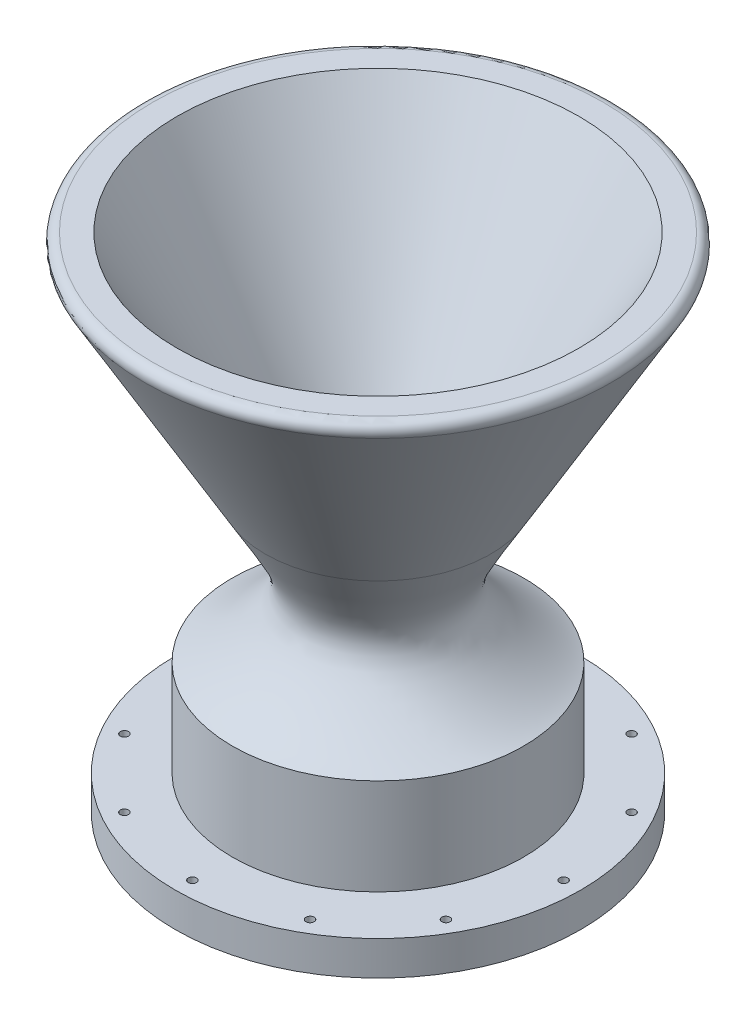
ISO-10303-21;
HEADER;
FILE_DESCRIPTION(('STEP AP214'),'2;1');
FILE_NAME('part.step','',(''),(''),'','','');
FILE_SCHEMA(('AUTOMOTIVE_DESIGN { 1 0 10303 214 1 1 1 1 }'));
ENDSEC;
DATA;
#1=APPLICATION_CONTEXT('core data for automotive mechanical design processes');
#2=APPLICATION_PROTOCOL_DEFINITION('international standard','automotive_design',2000,#1);
#3=PRODUCT_CONTEXT('',#1,'mechanical');
#4=PRODUCT('Part','Part','',(#3));
#5=PRODUCT_RELATED_PRODUCT_CATEGORY('part','',(#4));
#6=PRODUCT_DEFINITION_FORMATION('','',#4);
#7=PRODUCT_DEFINITION_CONTEXT('part definition',#1,'design');
#8=PRODUCT_DEFINITION('design','',#6,#7);
#9=PRODUCT_DEFINITION_SHAPE('','',#8);
#10=(LENGTH_UNIT() NAMED_UNIT(*) SI_UNIT(.MILLI.,.METRE.));
#11=(NAMED_UNIT(*) PLANE_ANGLE_UNIT() SI_UNIT($,.RADIAN.));
#12=(NAMED_UNIT(*) SI_UNIT($,.STERADIAN.) SOLID_ANGLE_UNIT());
#13=UNCERTAINTY_MEASURE_WITH_UNIT(LENGTH_MEASURE(1.E-05),#10,'distance_accuracy_value','');
#14=(GEOMETRIC_REPRESENTATION_CONTEXT(3) GLOBAL_UNCERTAINTY_ASSIGNED_CONTEXT((#13)) GLOBAL_UNIT_ASSIGNED_CONTEXT((#10,
#11,#12)) REPRESENTATION_CONTEXT('',''));
#15=CARTESIAN_POINT('',(0.,0.,0.));
#16=DIRECTION('',(0.,0.,1.));
#17=DIRECTION('',(1.,0.,0.));
#18=AXIS2_PLACEMENT_3D('',#15,#16,#17);
#19=CARTESIAN_POINT('',(0.,0.,0.));
#20=DIRECTION('',(0.,1.,0.));
#21=DIRECTION('',(0.,0.,1.));
#22=AXIS2_PLACEMENT_3D('',#19,#20,#21);
#23=PLANE('',#22);
#24=CARTESIAN_POINT('',(-25.8190999999994,0.,44.7199930057019));
#25=DIRECTION('',(0.,-1.,0.));
#26=DIRECTION('',(0.,0.,-1.));
#27=AXIS2_PLACEMENT_3D('',#24,#25,#26);
#28=CIRCLE('',#27,1.13029999999999);
#29=CARTESIAN_POINT('',(-25.8190999999994,0.,43.5896930057019));
#30=VERTEX_POINT('',#29);
#31=EDGE_CURVE('E111',#30,#30,#28,.T.);
#32=ORIENTED_EDGE('',*,*,#31,.F.);
#33=EDGE_LOOP('',(#32));
#34=FACE_BOUND('',#33,.T.);
#35=CARTESIAN_POINT('',(-44.7199930057013,0.,25.8191000000005));
#36=DIRECTION('',(0.,-1.,0.));
#37=DIRECTION('',(0.,0.,-1.));
#38=AXIS2_PLACEMENT_3D('',#35,#36,#37);
#39=CIRCLE('',#38,1.13029999999999);
#40=CARTESIAN_POINT('',(-44.7199930057013,0.,24.6888000000005));
#41=VERTEX_POINT('',#40);
#42=EDGE_CURVE('E115',#41,#41,#39,.T.);
#43=ORIENTED_EDGE('',*,*,#42,.F.);
#44=EDGE_LOOP('',(#43));
#45=FACE_BOUND('',#44,.T.);
#46=CARTESIAN_POINT('',(-51.6382,0.,5.40881435014348E-13));
#47=DIRECTION('',(0.,-1.,0.));
#48=DIRECTION('',(0.,0.,-1.));
#49=AXIS2_PLACEMENT_3D('',#46,#47,#48);
#50=CIRCLE('',#49,1.13029999999999);
#51=CARTESIAN_POINT('',(-51.6382,0.,-1.13029999999945));
#52=VERTEX_POINT('',#51);
#53=EDGE_CURVE('E119',#52,#52,#50,.T.);
#54=ORIENTED_EDGE('',*,*,#53,.F.);
#55=EDGE_LOOP('',(#54));
#56=FACE_BOUND('',#55,.T.);
#57=CARTESIAN_POINT('',(-44.7199930057018,0.,-25.8190999999996));
#58=DIRECTION('',(0.,-1.,0.));
#59=DIRECTION('',(0.,0.,-1.));
#60=AXIS2_PLACEMENT_3D('',#57,#58,#59);
#61=CIRCLE('',#60,1.13029999999999);
#62=CARTESIAN_POINT('',(-44.7199930057018,0.,-26.9493999999996));
#63=VERTEX_POINT('',#62);
#64=EDGE_CURVE('E123',#63,#63,#61,.T.);
#65=ORIENTED_EDGE('',*,*,#64,.F.);
#66=EDGE_LOOP('',(#65));
#67=FACE_BOUND('',#66,.T.);
#68=CARTESIAN_POINT('',(-25.8191000000004,0.,-44.7199930057014));
#69=DIRECTION('',(0.,-1.,0.));
#70=DIRECTION('',(0.,0.,-1.));
#71=AXIS2_PLACEMENT_3D('',#68,#69,#70);
#72=CIRCLE('',#71,1.13029999999999);
#73=CARTESIAN_POINT('',(-25.8191000000004,0.,-45.8502930057014));
#74=VERTEX_POINT('',#73);
#75=EDGE_CURVE('E127',#74,#74,#72,.T.);
#76=ORIENTED_EDGE('',*,*,#75,.F.);
#77=EDGE_LOOP('',(#76));
#78=FACE_BOUND('',#77,.T.);
#79=CARTESIAN_POINT('',(25.8190999999997,0.,-44.7199930057018));
#80=DIRECTION('',(0.,-1.,0.));
#81=DIRECTION('',(0.,0.,-1.));
#82=AXIS2_PLACEMENT_3D('',#79,#80,#81);
#83=CIRCLE('',#82,1.13029999999999);
#84=CARTESIAN_POINT('',(25.8190999999997,0.,-45.8502930057017));
#85=VERTEX_POINT('',#84);
#86=EDGE_CURVE('E131',#85,#85,#83,.T.);
#87=ORIENTED_EDGE('',*,*,#86,.F.);
#88=EDGE_LOOP('',(#87));
#89=FACE_BOUND('',#88,.T.);
#90=CARTESIAN_POINT('',(44.7199930057015,0.,-25.8191000000002));
#91=DIRECTION('',(0.,-1.,0.));
#92=DIRECTION('',(0.,0.,-1.));
#93=AXIS2_PLACEMENT_3D('',#90,#91,#92);
#94=CIRCLE('',#93,1.13029999999999);
#95=CARTESIAN_POINT('',(44.7199930057015,0.,-26.9494000000002));
#96=VERTEX_POINT('',#95);
#97=EDGE_CURVE('E135',#96,#96,#94,.T.);
#98=ORIENTED_EDGE('',*,*,#97,.F.);
#99=EDGE_LOOP('',(#98));
#100=FACE_BOUND('',#99,.T.);
#101=CARTESIAN_POINT('',(51.6382,0.,-1.80293811671449E-13));
#102=DIRECTION('',(0.,-1.,0.));
#103=DIRECTION('',(0.,0.,-1.));
#104=AXIS2_PLACEMENT_3D('',#101,#102,#103);
#105=CIRCLE('',#104,1.13029999999999);
#106=CARTESIAN_POINT('',(51.6382,0.,-1.13030000000017));
#107=VERTEX_POINT('',#106);
#108=EDGE_CURVE('E139',#107,#107,#105,.T.);
#109=ORIENTED_EDGE('',*,*,#108,.F.);
#110=EDGE_LOOP('',(#109));
#111=FACE_BOUND('',#110,.T.);
#112=CARTESIAN_POINT('',(44.7199930057017,0.,25.8190999999999));
#113=DIRECTION('',(0.,-1.,0.));
#114=DIRECTION('',(0.,0.,-1.));
#115=AXIS2_PLACEMENT_3D('',#112,#113,#114);
#116=CIRCLE('',#115,1.13029999999999);
#117=CARTESIAN_POINT('',(44.7199930057017,0.,24.6887999999999));
#118=VERTEX_POINT('',#117);
#119=EDGE_CURVE('E143',#118,#118,#116,.T.);
#120=ORIENTED_EDGE('',*,*,#119,.F.);
#121=EDGE_LOOP('',(#120));
#122=FACE_BOUND('',#121,.T.);
#123=CARTESIAN_POINT('',(25.8191,0.,44.7199930057016));
#124=DIRECTION('',(0.,-1.,0.));
#125=DIRECTION('',(0.,0.,-1.));
#126=AXIS2_PLACEMENT_3D('',#123,#124,#125);
#127=CIRCLE('',#126,1.13029999999999);
#128=CARTESIAN_POINT('',(25.8191,0.,43.5896930057016));
#129=VERTEX_POINT('',#128);
#130=EDGE_CURVE('E147',#129,#129,#127,.T.);
#131=ORIENTED_EDGE('',*,*,#130,.F.);
#132=EDGE_LOOP('',(#131));
#133=FACE_BOUND('',#132,.T.);
#134=CARTESIAN_POINT('',(0.,0.,51.6382));
#135=DIRECTION('',(0.,-1.,0.));
#136=DIRECTION('',(0.,0.,-1.));
#137=AXIS2_PLACEMENT_3D('',#134,#135,#136);
#138=CIRCLE('',#137,1.13029999999999);
#139=CARTESIAN_POINT('',(0.,0.,50.5079));
#140=VERTEX_POINT('',#139);
#141=EDGE_CURVE('E151',#140,#140,#138,.T.);
#142=ORIENTED_EDGE('',*,*,#141,.F.);
#143=EDGE_LOOP('',(#142));
#144=FACE_BOUND('',#143,.T.);
#145=CARTESIAN_POINT('',(0.,0.,0.));
#146=DIRECTION('',(0.,1.,0.));
#147=DIRECTION('',(0.,0.,1.));
#148=AXIS2_PLACEMENT_3D('',#145,#146,#147);
#149=CIRCLE('',#148,56.388);
#150=CARTESIAN_POINT('',(0.,0.,56.388));
#151=VERTEX_POINT('',#150);
#152=EDGE_CURVE('E10',#151,#151,#149,.T.);
#153=ORIENTED_EDGE('',*,*,#152,.F.);
#154=EDGE_LOOP('',(#153));
#155=FACE_BOUND('',#154,.T.);
#156=CARTESIAN_POINT('',(0.,0.,-51.6382));
#157=DIRECTION('',(0.,-1.,0.));
#158=DIRECTION('',(0.,0.,-1.));
#159=AXIS2_PLACEMENT_3D('',#156,#157,#158);
#160=CIRCLE('',#159,1.13029999999999);
#161=CARTESIAN_POINT('',(0.,0.,-52.7685));
#162=VERTEX_POINT('',#161);
#163=EDGE_CURVE('E155',#162,#162,#160,.T.);
#164=ORIENTED_EDGE('',*,*,#163,.F.);
#165=EDGE_LOOP('',(#164));
#166=FACE_BOUND('',#165,.T.);
#167=ADVANCED_FACE('F32',(#34,#45,#56,#67,#78,#89,#100,#111,#122,#133,#144,#155,#166),#23,.F.);
#168=CARTESIAN_POINT('',(0.,6.35,0.));
#169=DIRECTION('',(0.,1.,0.));
#170=DIRECTION('',(0.,0.,1.));
#171=AXIS2_PLACEMENT_3D('',#168,#169,#170);
#172=CYLINDRICAL_SURFACE('',#171,56.388);
#173=CARTESIAN_POINT('',(0.,9.525,0.));
#174=DIRECTION('',(0.,1.,0.));
#175=DIRECTION('',(0.,0.,1.));
#176=AXIS2_PLACEMENT_3D('',#173,#174,#175);
#177=CIRCLE('',#176,56.388);
#178=CARTESIAN_POINT('',(0.,9.525,56.388));
#179=VERTEX_POINT('',#178);
#180=EDGE_CURVE('E38',#179,#179,#177,.T.);
#181=ORIENTED_EDGE('',*,*,#180,.F.);
#182=EDGE_LOOP('',(#181));
#183=FACE_BOUND('',#182,.T.);
#184=ORIENTED_EDGE('',*,*,#152,.T.);
#185=EDGE_LOOP('',(#184));
#186=FACE_BOUND('',#185,.T.);
#187=ADVANCED_FACE('F98',(#183,#186),#172,.T.);
#188=CARTESIAN_POINT('',(56.388,9.525,0.));
#189=DIRECTION('',(0.,-1.,0.));
#190=DIRECTION('',(0.,0.,-1.));
#191=AXIS2_PLACEMENT_3D('',#188,#189,#190);
#192=PLANE('',#191);
#193=CARTESIAN_POINT('',(-25.8190999999994,9.525,44.7199930057019));
#194=DIRECTION('',(0.,-1.,0.));
#195=DIRECTION('',(0.,0.,-1.));
#196=AXIS2_PLACEMENT_3D('',#193,#194,#195);
#197=CIRCLE('',#196,1.13029999999999);
#198=CARTESIAN_POINT('',(-25.8190999999994,9.525,43.5896930057019));
#199=VERTEX_POINT('',#198);
#200=EDGE_CURVE('E371',#199,#199,#197,.T.);
#201=ORIENTED_EDGE('',*,*,#200,.T.);
#202=EDGE_LOOP('',(#201));
#203=FACE_BOUND('',#202,.T.);
#204=CARTESIAN_POINT('',(-44.7199930057013,9.525,25.8191000000005));
#205=DIRECTION('',(0.,-1.,0.));
#206=DIRECTION('',(0.,0.,-1.));
#207=AXIS2_PLACEMENT_3D('',#204,#205,#206);
#208=CIRCLE('',#207,1.13029999999998);
#209=CARTESIAN_POINT('',(-44.7199930057013,9.525,24.6888000000005));
#210=VERTEX_POINT('',#209);
#211=EDGE_CURVE('E376',#210,#210,#208,.T.);
#212=ORIENTED_EDGE('',*,*,#211,.T.);
#213=EDGE_LOOP('',(#212));
#214=FACE_BOUND('',#213,.T.);
#215=CARTESIAN_POINT('',(-51.6382,9.525,5.40881435014348E-13));
#216=DIRECTION('',(0.,-1.,0.));
#217=DIRECTION('',(0.,0.,-1.));
#218=AXIS2_PLACEMENT_3D('',#215,#216,#217);
#219=CIRCLE('',#218,1.13029999999998);
#220=CARTESIAN_POINT('',(-51.6382,9.525,-1.13029999999944));
#221=VERTEX_POINT('',#220);
#222=EDGE_CURVE('E380',#221,#221,#219,.T.);
#223=ORIENTED_EDGE('',*,*,#222,.T.);
#224=EDGE_LOOP('',(#223));
#225=FACE_BOUND('',#224,.T.);
#226=CARTESIAN_POINT('',(-44.7199930057018,9.525,-25.8190999999996));
#227=DIRECTION('',(0.,-1.,0.));
#228=DIRECTION('',(0.,0.,-1.));
#229=AXIS2_PLACEMENT_3D('',#226,#227,#228);
#230=CIRCLE('',#229,1.13029999999998);
#231=CARTESIAN_POINT('',(-44.7199930057018,9.525,-26.9493999999996));
#232=VERTEX_POINT('',#231);
#233=EDGE_CURVE('E384',#232,#232,#230,.T.);
#234=ORIENTED_EDGE('',*,*,#233,.T.);
#235=EDGE_LOOP('',(#234));
#236=FACE_BOUND('',#235,.T.);
#237=CARTESIAN_POINT('',(-25.8191000000004,9.525,-44.7199930057014));
#238=DIRECTION('',(0.,-1.,0.));
#239=DIRECTION('',(0.,0.,-1.));
#240=AXIS2_PLACEMENT_3D('',#237,#238,#239);
#241=CIRCLE('',#240,1.13029999999999);
#242=CARTESIAN_POINT('',(-25.8191000000004,9.525,-45.8502930057014));
#243=VERTEX_POINT('',#242);
#244=EDGE_CURVE('E158',#243,#243,#241,.T.);
#245=ORIENTED_EDGE('',*,*,#244,.T.);
#246=EDGE_LOOP('',(#245));
#247=FACE_BOUND('',#246,.T.);
#248=CARTESIAN_POINT('',(0.,9.525,-51.6382));
#249=DIRECTION('',(0.,-1.,0.));
#250=DIRECTION('',(0.,0.,-1.));
#251=AXIS2_PLACEMENT_3D('',#248,#249,#250);
#252=CIRCLE('',#251,1.13029999999998);
#253=CARTESIAN_POINT('',(0.,9.525,-52.7685));
#254=VERTEX_POINT('',#253);
#255=EDGE_CURVE('E157',#254,#254,#252,.T.);
#256=ORIENTED_EDGE('',*,*,#255,.T.);
#257=EDGE_LOOP('',(#256));
#258=FACE_BOUND('',#257,.T.);
#259=CARTESIAN_POINT('',(25.8190999999997,9.525,-44.7199930057018));
#260=DIRECTION('',(0.,-1.,0.));
#261=DIRECTION('',(0.,0.,-1.));
#262=AXIS2_PLACEMENT_3D('',#259,#260,#261);
#263=CIRCLE('',#262,1.13029999999999);
#264=CARTESIAN_POINT('',(25.8190999999997,9.525,-45.8502930057017));
#265=VERTEX_POINT('',#264);
#266=EDGE_CURVE('E167',#265,#265,#263,.T.);
#267=ORIENTED_EDGE('',*,*,#266,.T.);
#268=EDGE_LOOP('',(#267));
#269=FACE_BOUND('',#268,.T.);
#270=CARTESIAN_POINT('',(44.7199930057015,9.525,-25.8191000000002));
#271=DIRECTION('',(0.,-1.,0.));
#272=DIRECTION('',(0.,0.,-1.));
#273=AXIS2_PLACEMENT_3D('',#270,#271,#272);
#274=CIRCLE('',#273,1.13029999999998);
#275=CARTESIAN_POINT('',(44.7199930057015,9.525,-26.9494000000002));
#276=VERTEX_POINT('',#275);
#277=EDGE_CURVE('E171',#276,#276,#274,.T.);
#278=ORIENTED_EDGE('',*,*,#277,.T.);
#279=EDGE_LOOP('',(#278));
#280=FACE_BOUND('',#279,.T.);
#281=CARTESIAN_POINT('',(51.6382,9.525,-1.80293811671449E-13));
#282=DIRECTION('',(0.,-1.,0.));
#283=DIRECTION('',(0.,0.,-1.));
#284=AXIS2_PLACEMENT_3D('',#281,#282,#283);
#285=CIRCLE('',#284,1.13029999999998);
#286=CARTESIAN_POINT('',(51.6382,9.525,-1.13030000000016));
#287=VERTEX_POINT('',#286);
#288=EDGE_CURVE('E175',#287,#287,#285,.T.);
#289=ORIENTED_EDGE('',*,*,#288,.T.);
#290=EDGE_LOOP('',(#289));
#291=FACE_BOUND('',#290,.T.);
#292=CARTESIAN_POINT('',(44.7199930057017,9.525,25.8190999999999));
#293=DIRECTION('',(0.,-1.,0.));
#294=DIRECTION('',(0.,0.,-1.));
#295=AXIS2_PLACEMENT_3D('',#292,#293,#294);
#296=CIRCLE('',#295,1.13029999999998);
#297=CARTESIAN_POINT('',(44.7199930057017,9.525,24.6887999999999));
#298=VERTEX_POINT('',#297);
#299=EDGE_CURVE('E179',#298,#298,#296,.T.);
#300=ORIENTED_EDGE('',*,*,#299,.T.);
#301=EDGE_LOOP('',(#300));
#302=FACE_BOUND('',#301,.T.);
#303=CARTESIAN_POINT('',(25.8191,9.525,44.7199930057016));
#304=DIRECTION('',(0.,-1.,0.));
#305=DIRECTION('',(0.,0.,-1.));
#306=AXIS2_PLACEMENT_3D('',#303,#304,#305);
#307=CIRCLE('',#306,1.13029999999999);
#308=CARTESIAN_POINT('',(25.8191,9.525,43.5896930057016));
#309=VERTEX_POINT('',#308);
#310=EDGE_CURVE('E183',#309,#309,#307,.T.);
#311=ORIENTED_EDGE('',*,*,#310,.T.);
#312=EDGE_LOOP('',(#311));
#313=FACE_BOUND('',#312,.T.);
#314=CARTESIAN_POINT('',(0.,9.525,51.6382));
#315=DIRECTION('',(0.,-1.,0.));
#316=DIRECTION('',(0.,0.,-1.));
#317=AXIS2_PLACEMENT_3D('',#314,#315,#316);
#318=CIRCLE('',#317,1.13029999999999);
#319=CARTESIAN_POINT('',(0.,9.525,50.5079));
#320=VERTEX_POINT('',#319);
#321=EDGE_CURVE('E75',#320,#320,#318,.T.);
#322=ORIENTED_EDGE('',*,*,#321,.T.);
#323=EDGE_LOOP('',(#322));
#324=FACE_BOUND('',#323,.T.);
#325=CARTESIAN_POINT('',(0.,9.525,0.));
#326=DIRECTION('',(0.,1.,0.));
#327=DIRECTION('',(0.,0.,1.));
#328=AXIS2_PLACEMENT_3D('',#325,#326,#327);
#329=CIRCLE('',#328,40.513);
#330=CARTESIAN_POINT('',(0.,9.525,40.513));
#331=VERTEX_POINT('',#330);
#332=EDGE_CURVE('E42',#331,#331,#329,.T.);
#333=ORIENTED_EDGE('',*,*,#332,.F.);
#334=EDGE_LOOP('',(#333));
#335=FACE_BOUND('',#334,.T.);
#336=ORIENTED_EDGE('',*,*,#180,.T.);
#337=EDGE_LOOP('',(#336));
#338=FACE_BOUND('',#337,.T.);
#339=ADVANCED_FACE('F95',(#203,#214,#225,#236,#247,#258,#269,#280,#291,#302,#313,#324,#335,
#338),#192,.F.);
#340=CARTESIAN_POINT('',(0.,6.35,0.));
#341=DIRECTION('',(0.,1.,0.));
#342=DIRECTION('',(0.,0.,1.));
#343=AXIS2_PLACEMENT_3D('',#340,#341,#342);
#344=CYLINDRICAL_SURFACE('',#343,40.513);
#345=CARTESIAN_POINT('',(0.,36.2737107715748,0.));
#346=DIRECTION('',(0.,1.,0.));
#347=DIRECTION('',(0.,0.,1.));
#348=AXIS2_PLACEMENT_3D('',#345,#346,#347);
#349=CIRCLE('',#348,40.513);
#350=CARTESIAN_POINT('',(0.,36.2737107715748,40.513));
#351=VERTEX_POINT('',#350);
#352=EDGE_CURVE('E46',#351,#351,#349,.T.);
#353=ORIENTED_EDGE('',*,*,#352,.F.);
#354=EDGE_LOOP('',(#353));
#355=FACE_BOUND('',#354,.T.);
#356=ORIENTED_EDGE('',*,*,#332,.T.);
#357=EDGE_LOOP('',(#356));
#358=FACE_BOUND('',#357,.T.);
#359=ADVANCED_FACE('F90',(#355,#358),#344,.T.);
#360=CARTESIAN_POINT('',(40.513,36.2737107715748,0.));
#361=CARTESIAN_POINT('',(35.0255377789964,38.6063215320651,0.));
#362=CARTESIAN_POINT('',(14.4962391060081,54.5120255775279,0.));
#363=CARTESIAN_POINT('',(21.9947398839052,61.4955525582558,0.));
#364=CARTESIAN_POINT('',(31.3500177524556,77.9410845600295,0.));
#365=B_SPLINE_CURVE_WITH_KNOTS('',3,(#360,#361,#362,#363,#364),.UNSPECIFIED.,.F.,.F.,(4,1,4),
(0.,0.229459956894515,0.739608490515833),.UNSPECIFIED.);
#366=CARTESIAN_POINT('',(0.,6.35,0.));
#367=DIRECTION('',(0.,1.,0.));
#368=AXIS1_PLACEMENT('',#366,#367);
#369=SURFACE_OF_REVOLUTION('',#365,#368);
#370=CARTESIAN_POINT('',(0.,77.9410845600295,0.));
#371=DIRECTION('',(0.,1.,0.));
#372=DIRECTION('',(0.,0.,1.));
#373=AXIS2_PLACEMENT_3D('',#370,#371,#372);
#374=CIRCLE('',#373,31.3500177524556);
#375=CARTESIAN_POINT('',(0.,77.9410845600295,31.3500177524556));
#376=VERTEX_POINT('',#375);
#377=EDGE_CURVE('E51',#376,#376,#374,.T.);
#378=ORIENTED_EDGE('',*,*,#377,.F.);
#379=EDGE_LOOP('',(#378));
#380=FACE_BOUND('',#379,.T.);
#381=ORIENTED_EDGE('',*,*,#352,.T.);
#382=EDGE_LOOP('',(#381));
#383=FACE_BOUND('',#382,.T.);
#384=ADVANCED_FACE('F85',(#380,#383),#369,.T.);
#385=CARTESIAN_POINT('',(0.,77.9410845600295,0.));
#386=DIRECTION('',(0.,1.,0.));
#387=DIRECTION('',(0.,0.,1.));
#388=AXIS2_PLACEMENT_3D('',#385,#386,#387);
#389=CONICAL_SURFACE('',#388,31.3500177524556,0.523598775598296);
#390=CARTESIAN_POINT('',(0.,135.974635331849,0.));
#391=DIRECTION('',(0.,1.,0.));
#392=DIRECTION('',(0.,0.,1.));
#393=AXIS2_PLACEMENT_3D('',#390,#391,#392);
#394=CIRCLE('',#393,64.855703912595);
#395=CARTESIAN_POINT('',(0.,135.974635331849,64.855703912595));
#396=VERTEX_POINT('',#395);
#397=EDGE_CURVE('E54',#396,#396,#394,.T.);
#398=ORIENTED_EDGE('',*,*,#397,.F.);
#399=EDGE_LOOP('',(#398));
#400=FACE_BOUND('',#399,.T.);
#401=ORIENTED_EDGE('',*,*,#377,.T.);
#402=EDGE_LOOP('',(#401));
#403=FACE_BOUND('',#402,.T.);
#404=ADVANCED_FACE('F89',(#400,#403),#389,.T.);
#405=CARTESIAN_POINT('',(0.,137.244635331849,0.));
#406=DIRECTION('',(0.,1.,0.));
#407=DIRECTION('',(0.,0.,1.));
#408=AXIS2_PLACEMENT_3D('',#405,#406,#407);
#409=TOROIDAL_SURFACE('',#408,62.6559993869825,2.53999999999999);
#410=CARTESIAN_POINT('',(0.,139.784635331849,0.));
#411=DIRECTION('',(0.,1.,0.));
#412=DIRECTION('',(0.,0.,1.));
#413=AXIS2_PLACEMENT_3D('',#410,#411,#412);
#414=CIRCLE('',#413,62.6559993869825);
#415=CARTESIAN_POINT('',(0.,139.784635331849,62.6559993869825));
#416=VERTEX_POINT('',#415);
#417=EDGE_CURVE('E57',#416,#416,#414,.T.);
#418=ORIENTED_EDGE('',*,*,#417,.F.);
#419=EDGE_LOOP('',(#418));
#420=FACE_BOUND('',#419,.T.);
#421=ORIENTED_EDGE('',*,*,#397,.T.);
#422=EDGE_LOOP('',(#421));
#423=FACE_BOUND('',#422,.T.);
#424=ADVANCED_FACE('F225',(#420,#423),#409,.T.);
#425=CARTESIAN_POINT('',(55.8799999999999,139.784635331849,0.));
#426=DIRECTION('',(0.,-1.,0.));
#427=DIRECTION('',(0.,0.,-1.));
#428=AXIS2_PLACEMENT_3D('',#425,#426,#427);
#429=PLANE('',#428);
#430=CARTESIAN_POINT('',(0.,139.784635331849,0.));
#431=DIRECTION('',(0.,1.,0.));
#432=DIRECTION('',(0.,0.,1.));
#433=AXIS2_PLACEMENT_3D('',#430,#431,#432);
#434=CIRCLE('',#433,55.8799999999999);
#435=CARTESIAN_POINT('',(0.,139.784635331849,55.8799999999999));
#436=VERTEX_POINT('',#435);
#437=EDGE_CURVE('E60',#436,#436,#434,.T.);
#438=ORIENTED_EDGE('',*,*,#437,.F.);
#439=EDGE_LOOP('',(#438));
#440=FACE_BOUND('',#439,.T.);
#441=ORIENTED_EDGE('',*,*,#417,.T.);
#442=EDGE_LOOP('',(#441));
#443=FACE_BOUND('',#442,.T.);
#444=ADVANCED_FACE('F222',(#440,#443),#429,.F.);
#445=CARTESIAN_POINT('',(0.,139.784635331849,0.));
#446=DIRECTION('',(0.,1.,0.));
#447=DIRECTION('',(0.,0.,1.));
#448=AXIS2_PLACEMENT_3D('',#445,#446,#447);
#449=CONICAL_SURFACE('',#448,55.8799999999999,0.523598775598296);
#450=CARTESIAN_POINT('',(0.,53.9961588329618,0.));
#451=DIRECTION('',(0.,1.,0.));
#452=DIRECTION('',(0.,0.,1.));
#453=AXIS2_PLACEMENT_3D('',#450,#451,#452);
#454=CIRCLE('',#453,6.35);
#455=CARTESIAN_POINT('',(0.,53.9961588329617,6.34999999999999));
#456=VERTEX_POINT('',#455);
#457=EDGE_CURVE('E63',#456,#456,#454,.T.);
#458=CARTESIAN_POINT('',(0.,53.9961588329617,6.34999999999999));
#459=CARTESIAN_POINT('',(0.,54.8897887964918,6.86593749999999));
#460=CARTESIAN_POINT('',(0.,55.7834187600219,7.38187499999999));
#461=CARTESIAN_POINT('',(0.,57.570678687082,8.41374999999999));
#462=CARTESIAN_POINT('',(0.,58.4643086506121,8.92968749999999));
#463=CARTESIAN_POINT('',(0.,60.2515685776723,9.96156249999998));
#464=CARTESIAN_POINT('',(0.,61.1451985412023,10.4775));
#465=CARTESIAN_POINT('',(0.,62.9324584682625,11.509375));
#466=CARTESIAN_POINT('',(0.,63.8260884317925,12.0253125));
#467=CARTESIAN_POINT('',(0.,65.6133483588527,13.0571875));
#468=CARTESIAN_POINT('',(0.,66.5069783223827,13.573125));
#469=CARTESIAN_POINT('',(0.,68.2942382494429,14.605));
#470=CARTESIAN_POINT('',(0.,69.187868212973,15.1209375));
#471=CARTESIAN_POINT('',(0.,70.9751281400331,16.1528125));
#472=CARTESIAN_POINT('',(0.,71.8687581035632,16.66875));
#473=CARTESIAN_POINT('',(0.,73.6560180306233,17.700625));
#474=CARTESIAN_POINT('',(0.,74.5496479941534,18.2165625));
#475=CARTESIAN_POINT('',(0.,76.3369079212135,19.2484375));
#476=CARTESIAN_POINT('',(0.,77.2305378847436,19.764375));
#477=CARTESIAN_POINT('',(0.,79.0177978118037,20.79625));
#478=CARTESIAN_POINT('',(0.,79.9114277753338,21.3121875));
#479=CARTESIAN_POINT('',(0.,81.698687702394,22.3440625));
#480=CARTESIAN_POINT('',(0.,82.592317665924,22.86));
#481=CARTESIAN_POINT('',(0.,84.3795775929842,23.891875));
#482=CARTESIAN_POINT('',(0.,85.2732075565143,24.4078125));
#483=CARTESIAN_POINT('',(0.,87.0604674835744,25.4396875));
#484=CARTESIAN_POINT('',(0.,87.9540974471045,25.955625));
#485=CARTESIAN_POINT('',(0.,89.7413573741646,26.9875));
#486=CARTESIAN_POINT('',(0.,90.6349873376947,27.5034375));
#487=CARTESIAN_POINT('',(0.,92.4222472647548,28.5353125));
#488=CARTESIAN_POINT('',(0.,93.3158772282849,29.05125));
#489=CARTESIAN_POINT('',(0.,95.1031371553451,30.083125));
#490=CARTESIAN_POINT('',(0.,95.9967671188751,30.5990625));
#491=CARTESIAN_POINT('',(0.,97.7840270459353,31.6309375));
#492=CARTESIAN_POINT('',(0.,98.6776570094653,32.146875));
#493=CARTESIAN_POINT('',(0.,100.464916936525,33.17875));
#494=CARTESIAN_POINT('',(0.,101.358546900056,33.6946875));
#495=CARTESIAN_POINT('',(0.,103.145806827116,34.7265625));
#496=CARTESIAN_POINT('',(0.,104.039436790646,35.2424999999999));
#497=CARTESIAN_POINT('',(0.,105.826696717706,36.2743749999999));
#498=CARTESIAN_POINT('',(0.,106.720326681236,36.7903124999999));
#499=CARTESIAN_POINT('',(0.,108.507586608296,37.8221874999999));
#500=CARTESIAN_POINT('',(0.,109.401216571826,38.3381249999999));
#501=CARTESIAN_POINT('',(0.,111.188476498886,39.3699999999999));
#502=CARTESIAN_POINT('',(0.,112.082106462416,39.8859374999999));
#503=CARTESIAN_POINT('',(0.,113.869366389477,40.9178124999999));
#504=CARTESIAN_POINT('',(0.,114.762996353007,41.4337499999999));
#505=CARTESIAN_POINT('',(0.,116.550256280067,42.4656249999999));
#506=CARTESIAN_POINT('',(0.,117.443886243597,42.9815624999999));
#507=CARTESIAN_POINT('',(0.,119.231146170657,44.0134374999999));
#508=CARTESIAN_POINT('',(0.,120.124776134187,44.5293749999999));
#509=CARTESIAN_POINT('',(0.,121.912036061247,45.5612499999999));
#510=CARTESIAN_POINT('',(0.,122.805666024777,46.0771874999999));
#511=CARTESIAN_POINT('',(0.,124.592925951837,47.1090624999999));
#512=CARTESIAN_POINT('',(0.,125.486555915367,47.6249999999999));
#513=CARTESIAN_POINT('',(0.,127.273815842428,48.6568749999999));
#514=CARTESIAN_POINT('',(0.,128.167445805958,49.1728124999999));
#515=CARTESIAN_POINT('',(0.,129.954705733018,50.2046874999999));
#516=CARTESIAN_POINT('',(0.,130.848335696548,50.7206249999999));
#517=CARTESIAN_POINT('',(0.,132.635595623608,51.7524999999999));
#518=CARTESIAN_POINT('',(0.,133.529225587138,52.2684374999999));
#519=CARTESIAN_POINT('',(0.,135.316485514198,53.3003124999999));
#520=CARTESIAN_POINT('',(0.,136.210115477728,53.8162499999999));
#521=CARTESIAN_POINT('',(0.,137.997375404788,54.8481249999999));
#522=CARTESIAN_POINT('',(0.,138.891005368319,55.3640624999999));
#523=CARTESIAN_POINT('',(0.,139.784635331849,55.8799999999999));
#524=B_SPLINE_CURVE_WITH_KNOTS('',3,(#458,#459,#460,#461,#462,#463,#464,#465,#466,#467,#468,
#469,#470,#471,#472,#473,#474,#475,#476,#477,#478,#479,#480,#481,#482,#483,#484,#485,#486,#487,
#488,#489,#490,#491,#492,#493,#494,#495,#496,#497,#498,#499,#500,#501,#502,#503,#504,#505,#506,
#507,#508,#509,#510,#511,#512,#513,#514,#515,#516,#517,#518,#519,#520,#521,#522,#523),
.UNSPECIFIED.,.F.,.F.,(4,2,2,2,2,2,2,2,2,2,2,2,2,2,2,2,2,2,2,2,2,2,2,2,2,2,2,2,2,2,2,2,4),(0.,
3.09562500000001,6.19125000000003,9.28687500000003,12.3825,15.4781250000001,18.5737500000001,
21.6693750000001,24.7650000000001,27.8606250000001,30.9562500000001,34.0518750000001,
37.1475000000001,40.2431250000001,43.3387500000001,46.4343750000001,49.5300000000001,
52.6256250000002,55.7212500000002,58.8168750000002,61.9125000000002,65.0081250000002,
68.1037500000002,71.1993750000002,74.2950000000002,77.3906250000002,80.4862500000002,
83.5818750000002,86.6775000000003,89.7731250000003,92.8687500000003,95.9643750000003,
99.0600000000003),.UNSPECIFIED.);
#525=EDGE_CURVE('BSEAM218',#456,#436,#524,.T.);
#526=ORIENTED_EDGE('',*,*,#457,.F.);
#527=ORIENTED_EDGE('',*,*,#437,.T.);
#528=ORIENTED_EDGE('',*,*,#525,.T.);
#529=ORIENTED_EDGE('',*,*,#525,.F.);
#530=EDGE_LOOP('',(#526,#528,#527,#529));
#531=FACE_BOUND('',#530,.T.);
#532=ADVANCED_FACE('F218',(#531),#449,.F.);
#533=CARTESIAN_POINT('',(0.,6.35,0.));
#534=DIRECTION('',(0.,1.,0.));
#535=DIRECTION('',(0.,0.,1.));
#536=AXIS2_PLACEMENT_3D('',#533,#534,#535);
#537=CYLINDRICAL_SURFACE('',#536,6.35);
#538=CARTESIAN_POINT('',(0.,41.2961588329618,0.));
#539=DIRECTION('',(0.,1.,0.));
#540=DIRECTION('',(0.,0.,1.));
#541=AXIS2_PLACEMENT_3D('',#538,#539,#540);
#542=CIRCLE('',#541,6.35);
#543=CARTESIAN_POINT('',(0.,41.2961588329618,-6.35000000000001));
#544=VERTEX_POINT('',#543);
#545=EDGE_CURVE('E66',#544,#544,#542,.T.);
#546=ORIENTED_EDGE('',*,*,#545,.F.);
#547=EDGE_LOOP('',(#546));
#548=FACE_BOUND('',#547,.T.);
#549=ORIENTED_EDGE('',*,*,#457,.T.);
#550=EDGE_LOOP('',(#549));
#551=FACE_BOUND('',#550,.T.);
#552=ADVANCED_FACE('F214',(#548,#551),#537,.F.);
#553=CARTESIAN_POINT('',(0.,41.2961588329618,0.));
#554=DIRECTION('',(0.,-1.,0.));
#555=DIRECTION('',(0.,0.,-1.));
#556=AXIS2_PLACEMENT_3D('',#553,#554,#555);
#557=CONICAL_SURFACE('',#556,6.35,1.0471975511966);
#558=CARTESIAN_POINT('',(0.,32.3873574485229,0.));
#559=DIRECTION('',(0.,1.,0.));
#560=DIRECTION('',(0.,0.,1.));
#561=AXIS2_PLACEMENT_3D('',#558,#559,#560);
#562=CIRCLE('',#561,21.7804966323882);
#563=CARTESIAN_POINT('',(0.,32.3873574485228,-21.7804966323882));
#564=VERTEX_POINT('',#563);
#565=EDGE_CURVE('E69',#564,#564,#562,.T.);
#566=CARTESIAN_POINT('',(0.,32.3873574485228,-21.7804966323882));
#567=CARTESIAN_POINT('',(0.,32.4801574629441,-21.6197622924675));
#568=CARTESIAN_POINT('',(0.,32.5729574773653,-21.4590279525468));
#569=CARTESIAN_POINT('',(0.,32.7585575062078,-21.1375592727054));
#570=CARTESIAN_POINT('',(0.,32.851357520629,-20.9768249327847));
#571=CARTESIAN_POINT('',(0.,33.0369575494715,-20.6553562529433));
#572=CARTESIAN_POINT('',(0.,33.1297575638928,-20.4946219130225));
#573=CARTESIAN_POINT('',(0.,33.3153575927352,-20.1731532331811));
#574=CARTESIAN_POINT('',(0.,33.4081576071565,-20.0124188932604));
#575=CARTESIAN_POINT('',(0.,33.593757635999,-19.690950213419));
#576=CARTESIAN_POINT('',(0.,33.6865576504202,-19.5302158734983));
#577=CARTESIAN_POINT('',(0.,33.8721576792627,-19.2087471936569));
#578=CARTESIAN_POINT('',(0.,33.9649576936839,-19.0480128537361));
#579=CARTESIAN_POINT('',(0.,34.1505577225264,-18.7265441738947));
#580=CARTESIAN_POINT('',(0.,34.2433577369476,-18.565809833974));
#581=CARTESIAN_POINT('',(0.,34.4289577657901,-18.2443411541326));
#582=CARTESIAN_POINT('',(0.,34.5217577802113,-18.0836068142119));
#583=CARTESIAN_POINT('',(0.,34.7073578090538,-17.7621381343705));
#584=CARTESIAN_POINT('',(0.,34.8001578234751,-17.6014037944498));
#585=CARTESIAN_POINT('',(0.,34.9857578523175,-17.2799351146083));
#586=CARTESIAN_POINT('',(0.,35.0785578667388,-17.1192007746876));
#587=CARTESIAN_POINT('',(0.,35.2641578955812,-16.7977320948462));
#588=CARTESIAN_POINT('',(0.,35.3569579100025,-16.6369977549255));
#589=CARTESIAN_POINT('',(0.,35.542557938845,-16.3155290750841));
#590=CARTESIAN_POINT('',(0.,35.6353579532662,-16.1547947351634));
#591=CARTESIAN_POINT('',(0.,35.8209579821087,-15.8333260553219));
#592=CARTESIAN_POINT('',(0.,35.9137579965299,-15.6725917154012));
#593=CARTESIAN_POINT('',(0.,36.0993580253724,-15.3511230355598));
#594=CARTESIAN_POINT('',(0.,36.1921580397936,-15.1903886956391));
#595=CARTESIAN_POINT('',(0.,36.3777580686361,-14.8689200157977));
#596=CARTESIAN_POINT('',(0.,36.4705580830574,-14.708185675877));
#597=CARTESIAN_POINT('',(0.,36.6561581118998,-14.3867169960355));
#598=CARTESIAN_POINT('',(0.,36.7489581263211,-14.2259826561148));
#599=CARTESIAN_POINT('',(0.,36.9345581551636,-13.9045139762734));
#600=CARTESIAN_POINT('',(0.,37.0273581695848,-13.7437796363527));
#601=CARTESIAN_POINT('',(0.,37.2129581984273,-13.4223109565113));
#602=CARTESIAN_POINT('',(0.,37.3057582128485,-13.2615766165906));
#603=CARTESIAN_POINT('',(0.,37.491358241691,-12.9401079367491));
#604=CARTESIAN_POINT('',(0.,37.5841582561122,-12.7793735968284));
#605=CARTESIAN_POINT('',(0.,37.7697582849547,-12.457904916987));
#606=CARTESIAN_POINT('',(0.,37.8625582993759,-12.2971705770663));
#607=CARTESIAN_POINT('',(0.,38.0481583282184,-11.9757018972249));
#608=CARTESIAN_POINT('',(0.,38.1409583426396,-11.8149675573042));
#609=CARTESIAN_POINT('',(0.,38.3265583714821,-11.4934988774627));
#610=CARTESIAN_POINT('',(0.,38.4193583859034,-11.332764537542));
#611=CARTESIAN_POINT('',(0.,38.6049584147458,-11.0112958577006));
#612=CARTESIAN_POINT('',(0.,38.6977584291671,-10.8505615177799));
#613=CARTESIAN_POINT('',(0.,38.8833584580096,-10.5290928379385));
#614=CARTESIAN_POINT('',(0.,38.9761584724308,-10.3683584980178));
#615=CARTESIAN_POINT('',(0.,39.1617585012733,-10.0468898181764));
#616=CARTESIAN_POINT('',(0.,39.2545585156945,-9.88615547825564));
#617=CARTESIAN_POINT('',(0.,39.440158544537,-9.56468679841422));
#618=CARTESIAN_POINT('',(0.,39.5329585589582,-9.40395245849351));
#619=CARTESIAN_POINT('',(0.,39.7185585878007,-9.08248377865209));
#620=CARTESIAN_POINT('',(0.,39.8113586022219,-8.92174943873138));
#621=CARTESIAN_POINT('',(0.,39.9969586310644,-8.60028075888996));
#622=CARTESIAN_POINT('',(0.,40.0897586454857,-8.43954641896925));
#623=CARTESIAN_POINT('',(0.,40.2753586743281,-8.11807773912783));
#624=CARTESIAN_POINT('',(0.,40.3681586887494,-7.95734339920711));
#625=CARTESIAN_POINT('',(0.,40.5537587175918,-7.63587471936569));
#626=CARTESIAN_POINT('',(0.,40.6465587320131,-7.47514037944498));
#627=CARTESIAN_POINT('',(0.,40.8321587608556,-7.15367169960356));
#628=CARTESIAN_POINT('',(0.,40.9249587752768,-6.99293735968285));
#629=CARTESIAN_POINT('',(0.,41.1105588041193,-6.67146867984143));
#630=CARTESIAN_POINT('',(0.,41.2033588185405,-6.51073433992072));
#631=CARTESIAN_POINT('',(0.,41.2961588329618,-6.35000000000001));
#632=B_SPLINE_CURVE_WITH_KNOTS('',3,(#566,#567,#568,#569,#570,#571,#572,#573,#574,#575,#576,
#577,#578,#579,#580,#581,#582,#583,#584,#585,#586,#587,#588,#589,#590,#591,#592,#593,#594,#595,
#596,#597,#598,#599,#600,#601,#602,#603,#604,#605,#606,#607,#608,#609,#610,#611,#612,#613,#614,
#615,#616,#617,#618,#619,#620,#621,#622,#623,#624,#625,#626,#627,#628,#629,#630,#631),
.UNSPECIFIED.,.F.,.F.,(4,2,2,2,2,2,2,2,2,2,2,2,2,2,2,2,2,2,2,2,2,2,2,2,2,2,2,2,2,2,2,2,4),(0.,
0.556800086527433,1.11360017305487,1.6704002595823,2.22720034610974,2.78400043263717,
3.34080051916461,3.89760060569204,4.45440069221947,5.01120077874691,5.56800086527434,
6.12480095180177,6.68160103832921,7.23840112485664,7.79520121138408,8.35200129791151,
8.90880138443894,9.46560147096637,10.0224015574938,10.5792016440212,11.1360017305487,
11.6928018170761,12.2496019036035,12.806401990131,13.3632020766584,13.9200021631858,
14.4768022497133,15.0336023362407,15.5904024227681,16.1472025092956,16.704002595823,
17.2608026823504,17.8176027688779),.UNSPECIFIED.);
#633=EDGE_CURVE('BSEAM210',#564,#544,#632,.T.);
#634=ORIENTED_EDGE('',*,*,#565,.F.);
#635=ORIENTED_EDGE('',*,*,#545,.T.);
#636=ORIENTED_EDGE('',*,*,#633,.T.);
#637=ORIENTED_EDGE('',*,*,#633,.F.);
#638=EDGE_LOOP('',(#634,#636,#635,#637));
#639=FACE_BOUND('',#638,.T.);
#640=ADVANCED_FACE('F210',(#639),#557,.F.);
#641=CARTESIAN_POINT('',(0.,6.35,0.));
#642=DIRECTION('',(0.,1.,0.));
#643=DIRECTION('',(0.,0.,1.));
#644=AXIS2_PLACEMENT_3D('',#641,#642,#643);
#645=CYLINDRICAL_SURFACE('',#644,21.7804966323882);
#646=CARTESIAN_POINT('',(0.,6.35,0.));
#647=DIRECTION('',(0.,1.,0.));
#648=DIRECTION('',(0.,0.,1.));
#649=AXIS2_PLACEMENT_3D('',#646,#647,#648);
#650=CIRCLE('',#649,21.7804966323882);
#651=CARTESIAN_POINT('',(0.,6.35,21.7804966323882));
#652=VERTEX_POINT('',#651);
#653=EDGE_CURVE('E72',#652,#652,#650,.T.);
#654=ORIENTED_EDGE('',*,*,#653,.F.);
#655=EDGE_LOOP('',(#654));
#656=FACE_BOUND('',#655,.T.);
#657=ORIENTED_EDGE('',*,*,#565,.T.);
#658=EDGE_LOOP('',(#657));
#659=FACE_BOUND('',#658,.T.);
#660=ADVANCED_FACE('F203',(#656,#659),#645,.F.);
#661=CARTESIAN_POINT('',(21.7804966323882,6.35,0.));
#662=DIRECTION('',(0.,-1.,0.));
#663=DIRECTION('',(0.,0.,-1.));
#664=AXIS2_PLACEMENT_3D('',#661,#662,#663);
#665=PLANE('',#664);
#666=ORIENTED_EDGE('',*,*,#653,.T.);
#667=EDGE_LOOP('',(#666));
#668=FACE_BOUND('',#667,.T.);
#669=ADVANCED_FACE('F194',(#668),#665,.F.);
#670=CARTESIAN_POINT('',(0.,0.,51.6382));
#671=DIRECTION('',(0.,-1.,0.));
#672=DIRECTION('',(0.,0.,-1.));
#673=AXIS2_PLACEMENT_3D('',#670,#671,#672);
#674=CYLINDRICAL_SURFACE('',#673,1.13029999999999);
#675=ORIENTED_EDGE('',*,*,#321,.F.);
#676=EDGE_LOOP('',(#675));
#677=FACE_BOUND('',#676,.T.);
#678=ORIENTED_EDGE('',*,*,#141,.T.);
#679=EDGE_LOOP('',(#678));
#680=FACE_BOUND('',#679,.T.);
#681=ADVANCED_FACE('F191',(#677,#680),#674,.F.);
#682=CARTESIAN_POINT('',(25.8191,0.,44.7199930057016));
#683=DIRECTION('',(0.,-1.,0.));
#684=DIRECTION('',(0.,0.,-1.));
#685=AXIS2_PLACEMENT_3D('',#682,#683,#684);
#686=CYLINDRICAL_SURFACE('',#685,1.13029999999999);
#687=ORIENTED_EDGE('',*,*,#310,.F.);
#688=EDGE_LOOP('',(#687));
#689=FACE_BOUND('',#688,.T.);
#690=ORIENTED_EDGE('',*,*,#130,.T.);
#691=EDGE_LOOP('',(#690));
#692=FACE_BOUND('',#691,.T.);
#693=ADVANCED_FACE('F193',(#689,#692),#686,.F.);
#694=CARTESIAN_POINT('',(44.7199930057017,0.,25.8190999999999));
#695=DIRECTION('',(0.,-1.,0.));
#696=DIRECTION('',(0.,0.,-1.));
#697=AXIS2_PLACEMENT_3D('',#694,#695,#696);
#698=CYLINDRICAL_SURFACE('',#697,1.13029999999998);
#699=ORIENTED_EDGE('',*,*,#299,.F.);
#700=EDGE_LOOP('',(#699));
#701=FACE_BOUND('',#700,.T.);
#702=ORIENTED_EDGE('',*,*,#119,.T.);
#703=EDGE_LOOP('',(#702));
#704=FACE_BOUND('',#703,.T.);
#705=ADVANCED_FACE('F200',(#701,#704),#698,.F.);
#706=CARTESIAN_POINT('',(51.6382,0.,-1.80293811671449E-13));
#707=DIRECTION('',(0.,-1.,0.));
#708=DIRECTION('',(0.,0.,-1.));
#709=AXIS2_PLACEMENT_3D('',#706,#707,#708);
#710=CYLINDRICAL_SURFACE('',#709,1.13029999999998);
#711=ORIENTED_EDGE('',*,*,#288,.F.);
#712=EDGE_LOOP('',(#711));
#713=FACE_BOUND('',#712,.T.);
#714=ORIENTED_EDGE('',*,*,#108,.T.);
#715=EDGE_LOOP('',(#714));
#716=FACE_BOUND('',#715,.T.);
#717=ADVANCED_FACE('F275',(#713,#716),#710,.F.);
#718=CARTESIAN_POINT('',(44.7199930057015,0.,-25.8191000000002));
#719=DIRECTION('',(0.,-1.,0.));
#720=DIRECTION('',(0.,0.,-1.));
#721=AXIS2_PLACEMENT_3D('',#718,#719,#720);
#722=CYLINDRICAL_SURFACE('',#721,1.13029999999998);
#723=ORIENTED_EDGE('',*,*,#277,.F.);
#724=EDGE_LOOP('',(#723));
#725=FACE_BOUND('',#724,.T.);
#726=ORIENTED_EDGE('',*,*,#97,.T.);
#727=EDGE_LOOP('',(#726));
#728=FACE_BOUND('',#727,.T.);
#729=ADVANCED_FACE('F284',(#725,#728),#722,.F.);
#730=CARTESIAN_POINT('',(25.8190999999997,0.,-44.7199930057018));
#731=DIRECTION('',(0.,-1.,0.));
#732=DIRECTION('',(0.,0.,-1.));
#733=AXIS2_PLACEMENT_3D('',#730,#731,#732);
#734=CYLINDRICAL_SURFACE('',#733,1.13029999999999);
#735=ORIENTED_EDGE('',*,*,#266,.F.);
#736=EDGE_LOOP('',(#735));
#737=FACE_BOUND('',#736,.T.);
#738=ORIENTED_EDGE('',*,*,#86,.T.);
#739=EDGE_LOOP('',(#738));
#740=FACE_BOUND('',#739,.T.);
#741=ADVANCED_FACE('F294',(#737,#740),#734,.F.);
#742=CARTESIAN_POINT('',(0.,0.,-51.6382));
#743=DIRECTION('',(0.,-1.,0.));
#744=DIRECTION('',(0.,0.,-1.));
#745=AXIS2_PLACEMENT_3D('',#742,#743,#744);
#746=CYLINDRICAL_SURFACE('',#745,1.13029999999998);
#747=ORIENTED_EDGE('',*,*,#255,.F.);
#748=EDGE_LOOP('',(#747));
#749=FACE_BOUND('',#748,.T.);
#750=ORIENTED_EDGE('',*,*,#163,.T.);
#751=EDGE_LOOP('',(#750));
#752=FACE_BOUND('',#751,.T.);
#753=ADVANCED_FACE('F304',(#749,#752),#746,.F.);
#754=CARTESIAN_POINT('',(-25.8191000000004,0.,-44.7199930057014));
#755=DIRECTION('',(0.,-1.,0.));
#756=DIRECTION('',(0.,0.,-1.));
#757=AXIS2_PLACEMENT_3D('',#754,#755,#756);
#758=CYLINDRICAL_SURFACE('',#757,1.13029999999999);
#759=ORIENTED_EDGE('',*,*,#244,.F.);
#760=EDGE_LOOP('',(#759));
#761=FACE_BOUND('',#760,.T.);
#762=ORIENTED_EDGE('',*,*,#75,.T.);
#763=EDGE_LOOP('',(#762));
#764=FACE_BOUND('',#763,.T.);
#765=ADVANCED_FACE('F314',(#761,#764),#758,.F.);
#766=CARTESIAN_POINT('',(-44.7199930057018,0.,-25.8190999999996));
#767=DIRECTION('',(0.,-1.,0.));
#768=DIRECTION('',(0.,0.,-1.));
#769=AXIS2_PLACEMENT_3D('',#766,#767,#768);
#770=CYLINDRICAL_SURFACE('',#769,1.13029999999998);
#771=ORIENTED_EDGE('',*,*,#233,.F.);
#772=EDGE_LOOP('',(#771));
#773=FACE_BOUND('',#772,.T.);
#774=ORIENTED_EDGE('',*,*,#64,.T.);
#775=EDGE_LOOP('',(#774));
#776=FACE_BOUND('',#775,.T.);
#777=ADVANCED_FACE('F324',(#773,#776),#770,.F.);
#778=CARTESIAN_POINT('',(-51.6382,0.,5.40881435014348E-13));
#779=DIRECTION('',(0.,-1.,0.));
#780=DIRECTION('',(0.,0.,-1.));
#781=AXIS2_PLACEMENT_3D('',#778,#779,#780);
#782=CYLINDRICAL_SURFACE('',#781,1.13029999999998);
#783=ORIENTED_EDGE('',*,*,#222,.F.);
#784=EDGE_LOOP('',(#783));
#785=FACE_BOUND('',#784,.T.);
#786=ORIENTED_EDGE('',*,*,#53,.T.);
#787=EDGE_LOOP('',(#786));
#788=FACE_BOUND('',#787,.T.);
#789=ADVANCED_FACE('F334',(#785,#788),#782,.F.);
#790=CARTESIAN_POINT('',(-44.7199930057013,0.,25.8191000000005));
#791=DIRECTION('',(0.,-1.,0.));
#792=DIRECTION('',(0.,0.,-1.));
#793=AXIS2_PLACEMENT_3D('',#790,#791,#792);
#794=CYLINDRICAL_SURFACE('',#793,1.13029999999998);
#795=ORIENTED_EDGE('',*,*,#211,.F.);
#796=EDGE_LOOP('',(#795));
#797=FACE_BOUND('',#796,.T.);
#798=ORIENTED_EDGE('',*,*,#42,.T.);
#799=EDGE_LOOP('',(#798));
#800=FACE_BOUND('',#799,.T.);
#801=ADVANCED_FACE('F344',(#797,#800),#794,.F.);
#802=CARTESIAN_POINT('',(-25.8190999999994,0.,44.7199930057019));
#803=DIRECTION('',(0.,-1.,0.));
#804=DIRECTION('',(0.,0.,-1.));
#805=AXIS2_PLACEMENT_3D('',#802,#803,#804);
#806=CYLINDRICAL_SURFACE('',#805,1.13029999999999);
#807=ORIENTED_EDGE('',*,*,#200,.F.);
#808=EDGE_LOOP('',(#807));
#809=FACE_BOUND('',#808,.T.);
#810=ORIENTED_EDGE('',*,*,#31,.T.);
#811=EDGE_LOOP('',(#810));
#812=FACE_BOUND('',#811,.T.);
#813=ADVANCED_FACE('F354',(#809,#812),#806,.F.);
#814=CLOSED_SHELL('',(#167,#187,#339,#359,#384,#404,#424,#444,#532,#552,#640,#660,#669,#681,
#693,#705,#717,#729,#741,#753,#765,#777,#789,#801,#813));
#815=MANIFOLD_SOLID_BREP('B2',#814);
#816=ADVANCED_BREP_SHAPE_REPRESENTATION('',(#18,#815),#14);
#817=SHAPE_DEFINITION_REPRESENTATION(#9,#816);
ENDSEC;
END-ISO-10303-21;
